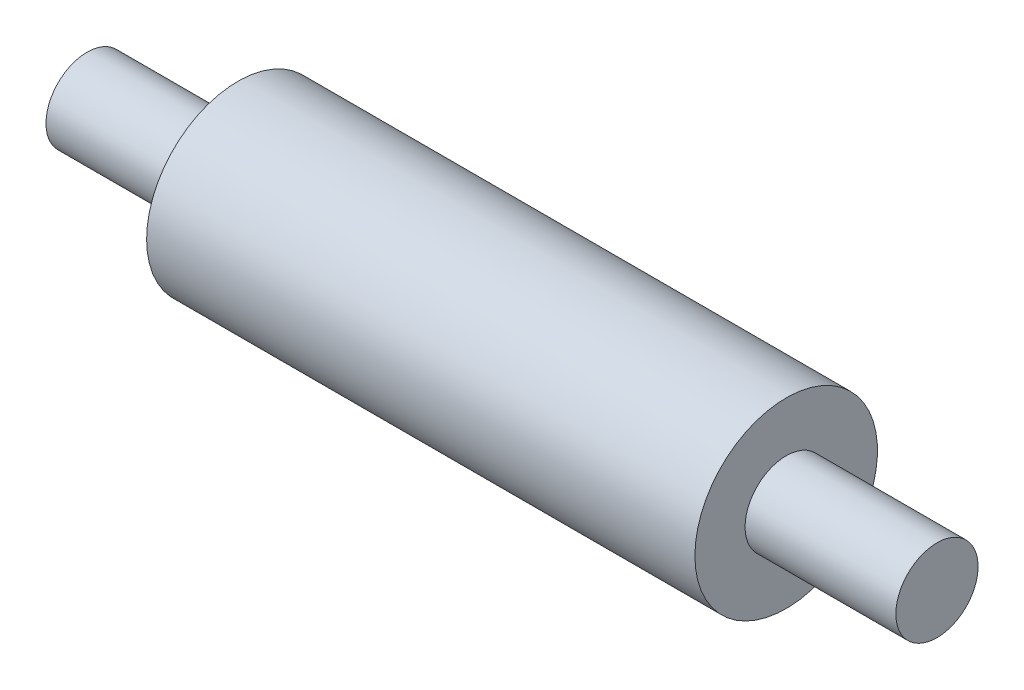
ISO-10303-21;
HEADER;
FILE_DESCRIPTION(('STEP AP214'),'2;1');
FILE_NAME('part.step','',(''),(''),'','','');
FILE_SCHEMA(('AUTOMOTIVE_DESIGN { 1 0 10303 214 1 1 1 1 }'));
ENDSEC;
DATA;
#1=APPLICATION_CONTEXT('core data for automotive mechanical design processes');
#2=APPLICATION_PROTOCOL_DEFINITION('international standard','automotive_design',2000,#1);
#3=PRODUCT_CONTEXT('',#1,'mechanical');
#4=PRODUCT('Part','Part','',(#3));
#5=PRODUCT_RELATED_PRODUCT_CATEGORY('part','',(#4));
#6=PRODUCT_DEFINITION_FORMATION('','',#4);
#7=PRODUCT_DEFINITION_CONTEXT('part definition',#1,'design');
#8=PRODUCT_DEFINITION('design','',#6,#7);
#9=PRODUCT_DEFINITION_SHAPE('','',#8);
#10=(LENGTH_UNIT() NAMED_UNIT(*) SI_UNIT(.MILLI.,.METRE.));
#11=(NAMED_UNIT(*) PLANE_ANGLE_UNIT() SI_UNIT($,.RADIAN.));
#12=(NAMED_UNIT(*) SI_UNIT($,.STERADIAN.) SOLID_ANGLE_UNIT());
#13=UNCERTAINTY_MEASURE_WITH_UNIT(LENGTH_MEASURE(1.E-05),#10,'distance_accuracy_value','');
#14=(GEOMETRIC_REPRESENTATION_CONTEXT(3) GLOBAL_UNCERTAINTY_ASSIGNED_CONTEXT((#13)) GLOBAL_UNIT_ASSIGNED_CONTEXT((#10,
#11,#12)) REPRESENTATION_CONTEXT('',''));
#15=CARTESIAN_POINT('',(0.,0.,0.));
#16=DIRECTION('',(0.,0.,1.));
#17=DIRECTION('',(1.,0.,0.));
#18=AXIS2_PLACEMENT_3D('',#15,#16,#17);
#19=CARTESIAN_POINT('',(-10.,0.,0.));
#20=DIRECTION('',(1.,0.,0.));
#21=DIRECTION('',(0.,0.,-1.));
#22=AXIS2_PLACEMENT_3D('',#19,#20,#21);
#23=PLANE('',#22);
#24=CARTESIAN_POINT('',(-10.,0.,0.));
#25=DIRECTION('',(-1.,0.,0.));
#26=DIRECTION('',(0.,0.,1.));
#27=AXIS2_PLACEMENT_3D('',#24,#25,#26);
#28=CIRCLE('',#27,1.5);
#29=CARTESIAN_POINT('',(-10.,0.,1.5));
#30=VERTEX_POINT('',#29);
#31=EDGE_CURVE('E10',#30,#30,#28,.T.);
#32=ORIENTED_EDGE('',*,*,#31,.F.);
#33=EDGE_LOOP('',(#32));
#34=FACE_BOUND('',#33,.T.);
#35=CARTESIAN_POINT('',(-10.,0.,0.));
#36=DIRECTION('',(-1.,0.,0.));
#37=DIRECTION('',(0.,0.,1.));
#38=AXIS2_PLACEMENT_3D('',#35,#36,#37);
#39=CIRCLE('',#38,3.33);
#40=CARTESIAN_POINT('',(-10.,0.,3.33));
#41=VERTEX_POINT('',#40);
#42=EDGE_CURVE('E55',#41,#41,#39,.T.);
#43=ORIENTED_EDGE('',*,*,#42,.T.);
#44=EDGE_LOOP('',(#43));
#45=FACE_BOUND('',#44,.T.);
#46=ADVANCED_FACE('F33',(#34,#45),#23,.F.);
#47=CARTESIAN_POINT('',(-15.5,0.,0.));
#48=DIRECTION('',(-1.,0.,0.));
#49=DIRECTION('',(0.,0.,1.));
#50=AXIS2_PLACEMENT_3D('',#47,#48,#49);
#51=CYLINDRICAL_SURFACE('',#50,1.5);
#52=ORIENTED_EDGE('',*,*,#31,.T.);
#53=EDGE_LOOP('',(#52));
#54=FACE_BOUND('',#53,.T.);
#55=CARTESIAN_POINT('',(-15.5,0.,0.));
#56=DIRECTION('',(-1.,0.,0.));
#57=DIRECTION('',(0.,0.,1.));
#58=AXIS2_PLACEMENT_3D('',#55,#56,#57);
#59=CIRCLE('',#58,1.5);
#60=CARTESIAN_POINT('',(-15.5,0.,1.5));
#61=VERTEX_POINT('',#60);
#62=EDGE_CURVE('E39',#61,#61,#59,.T.);
#63=ORIENTED_EDGE('',*,*,#62,.F.);
#64=EDGE_LOOP('',(#63));
#65=FACE_BOUND('',#64,.T.);
#66=ADVANCED_FACE('F72',(#54,#65),#51,.T.);
#67=CARTESIAN_POINT('',(-15.5,0.,0.));
#68=DIRECTION('',(1.,0.,0.));
#69=DIRECTION('',(0.,0.,-1.));
#70=AXIS2_PLACEMENT_3D('',#67,#68,#69);
#71=PLANE('',#70);
#72=ORIENTED_EDGE('',*,*,#62,.T.);
#73=EDGE_LOOP('',(#72));
#74=FACE_BOUND('',#73,.T.);
#75=ADVANCED_FACE('F77',(#74),#71,.F.);
#76=CARTESIAN_POINT('',(15.5,0.,0.));
#77=DIRECTION('',(1.,0.,0.));
#78=DIRECTION('',(0.,0.,-1.));
#79=AXIS2_PLACEMENT_3D('',#76,#77,#78);
#80=PLANE('',#79);
#81=CARTESIAN_POINT('',(15.5,0.,0.));
#82=DIRECTION('',(-1.,0.,0.));
#83=DIRECTION('',(0.,0.,1.));
#84=AXIS2_PLACEMENT_3D('',#81,#82,#83);
#85=CIRCLE('',#84,1.5);
#86=CARTESIAN_POINT('',(15.5,0.,1.5));
#87=VERTEX_POINT('',#86);
#88=EDGE_CURVE('E43',#87,#87,#85,.T.);
#89=ORIENTED_EDGE('',*,*,#88,.F.);
#90=EDGE_LOOP('',(#89));
#91=FACE_BOUND('',#90,.T.);
#92=ADVANCED_FACE('F81',(#91),#80,.T.);
#93=CARTESIAN_POINT('',(-15.5,0.,0.));
#94=DIRECTION('',(-1.,0.,0.));
#95=DIRECTION('',(0.,0.,1.));
#96=AXIS2_PLACEMENT_3D('',#93,#94,#95);
#97=CYLINDRICAL_SURFACE('',#96,1.5);
#98=ORIENTED_EDGE('',*,*,#88,.T.);
#99=EDGE_LOOP('',(#98));
#100=FACE_BOUND('',#99,.T.);
#101=CARTESIAN_POINT('',(10.,0.,0.));
#102=DIRECTION('',(-1.,0.,0.));
#103=DIRECTION('',(0.,0.,1.));
#104=AXIS2_PLACEMENT_3D('',#101,#102,#103);
#105=CIRCLE('',#104,1.5);
#106=CARTESIAN_POINT('',(10.,0.,1.5));
#107=VERTEX_POINT('',#106);
#108=EDGE_CURVE('E47',#107,#107,#105,.T.);
#109=ORIENTED_EDGE('',*,*,#108,.F.);
#110=EDGE_LOOP('',(#109));
#111=FACE_BOUND('',#110,.T.);
#112=ADVANCED_FACE('F68',(#100,#111),#97,.T.);
#113=CARTESIAN_POINT('',(10.,0.,0.));
#114=DIRECTION('',(1.,0.,0.));
#115=DIRECTION('',(0.,0.,-1.));
#116=AXIS2_PLACEMENT_3D('',#113,#114,#115);
#117=PLANE('',#116);
#118=ORIENTED_EDGE('',*,*,#108,.T.);
#119=EDGE_LOOP('',(#118));
#120=FACE_BOUND('',#119,.T.);
#121=CARTESIAN_POINT('',(10.,0.,0.));
#122=DIRECTION('',(-1.,0.,0.));
#123=DIRECTION('',(0.,0.,1.));
#124=AXIS2_PLACEMENT_3D('',#121,#122,#123);
#125=CIRCLE('',#124,3.33);
#126=CARTESIAN_POINT('',(10.,0.,3.33));
#127=VERTEX_POINT('',#126);
#128=EDGE_CURVE('E52',#127,#127,#125,.T.);
#129=ORIENTED_EDGE('',*,*,#128,.F.);
#130=EDGE_LOOP('',(#129));
#131=FACE_BOUND('',#130,.T.);
#132=ADVANCED_FACE('F62',(#120,#131),#117,.T.);
#133=CARTESIAN_POINT('',(-15.5,0.,0.));
#134=DIRECTION('',(-1.,0.,0.));
#135=DIRECTION('',(0.,0.,1.));
#136=AXIS2_PLACEMENT_3D('',#133,#134,#135);
#137=CYLINDRICAL_SURFACE('',#136,3.33);
#138=ORIENTED_EDGE('',*,*,#128,.T.);
#139=EDGE_LOOP('',(#138));
#140=FACE_BOUND('',#139,.T.);
#141=ORIENTED_EDGE('',*,*,#42,.F.);
#142=EDGE_LOOP('',(#141));
#143=FACE_BOUND('',#142,.T.);
#144=ADVANCED_FACE('F60',(#140,#143),#137,.T.);
#145=CLOSED_SHELL('',(#46,#66,#75,#92,#112,#132,#144));
#146=MANIFOLD_SOLID_BREP('B2',#145);
#147=ADVANCED_BREP_SHAPE_REPRESENTATION('',(#18,#146),#14);
#148=SHAPE_DEFINITION_REPRESENTATION(#9,#147);
ENDSEC;
END-ISO-10303-21;
